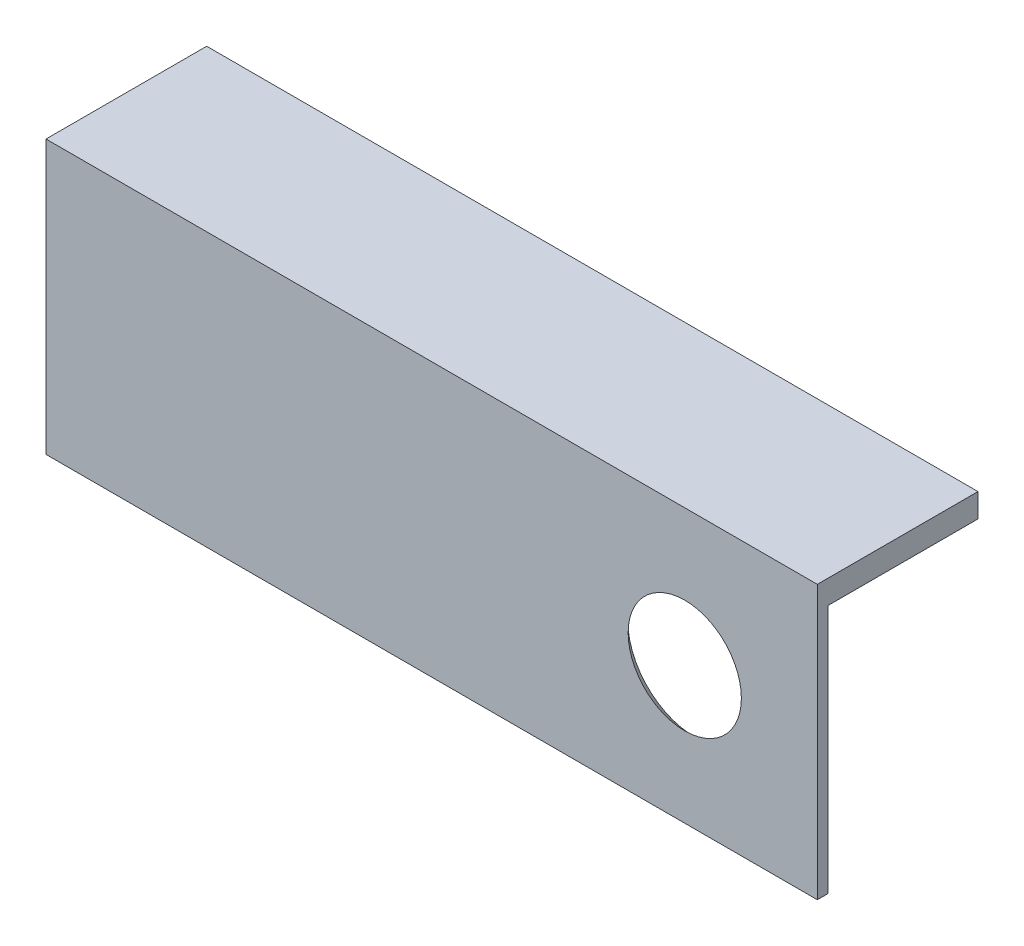
ISO-10303-21;
HEADER;
FILE_DESCRIPTION(('STEP AP214'),'2;1');
FILE_NAME('part.step','',(''),(''),'','','');
FILE_SCHEMA(('AUTOMOTIVE_DESIGN { 1 0 10303 214 1 1 1 1 }'));
ENDSEC;
DATA;
#1=APPLICATION_CONTEXT('core data for automotive mechanical design processes');
#2=APPLICATION_PROTOCOL_DEFINITION('international standard','automotive_design',2000,#1);
#3=PRODUCT_CONTEXT('',#1,'mechanical');
#4=PRODUCT('Part','Part','',(#3));
#5=PRODUCT_RELATED_PRODUCT_CATEGORY('part','',(#4));
#6=PRODUCT_DEFINITION_FORMATION('','',#4);
#7=PRODUCT_DEFINITION_CONTEXT('part definition',#1,'design');
#8=PRODUCT_DEFINITION('design','',#6,#7);
#9=PRODUCT_DEFINITION_SHAPE('','',#8);
#10=(LENGTH_UNIT() NAMED_UNIT(*) SI_UNIT(.MILLI.,.METRE.));
#11=(NAMED_UNIT(*) PLANE_ANGLE_UNIT() SI_UNIT($,.RADIAN.));
#12=(NAMED_UNIT(*) SI_UNIT($,.STERADIAN.) SOLID_ANGLE_UNIT());
#13=UNCERTAINTY_MEASURE_WITH_UNIT(LENGTH_MEASURE(1.E-05),#10,'distance_accuracy_value','');
#14=(GEOMETRIC_REPRESENTATION_CONTEXT(3) GLOBAL_UNCERTAINTY_ASSIGNED_CONTEXT((#13)) GLOBAL_UNIT_ASSIGNED_CONTEXT((#10,
#11,#12)) REPRESENTATION_CONTEXT('',''));
#15=CARTESIAN_POINT('',(0.,0.,0.));
#16=DIRECTION('',(0.,0.,1.));
#17=DIRECTION('',(1.,0.,0.));
#18=AXIS2_PLACEMENT_3D('',#15,#16,#17);
#19=CARTESIAN_POINT('',(0.,0.,10.));
#20=DIRECTION('',(0.,0.,1.));
#21=DIRECTION('',(1.,0.,0.));
#22=AXIS2_PLACEMENT_3D('',#19,#20,#21);
#23=PLANE('',#22);
#24=CARTESIAN_POINT('',(15.7508026527941,0.,10.));
#25=DIRECTION('',(0.,0.,1.));
#26=DIRECTION('',(1.,0.,0.));
#27=AXIS2_PLACEMENT_3D('',#24,#25,#26);
#28=CIRCLE('',#27,3.52287724515009);
#29=CARTESIAN_POINT('',(19.2736798979442,0.,10.));
#30=VERTEX_POINT('',#29);
#31=EDGE_CURVE('E40',#30,#30,#28,.T.);
#32=ORIENTED_EDGE('',*,*,#31,.F.);
#33=EDGE_LOOP('',(#32));
#34=FACE_BOUND('',#33,.T.);
#35=DIRECTION('',(0.,1.,0.));
#36=VECTOR('',#35,1.);
#37=CARTESIAN_POINT('',(24.,8.5,10.));
#38=LINE('',#37,#36);
#39=CARTESIAN_POINT('',(24.,-8.5,10.));
#40=VERTEX_POINT('',#39);
#41=CARTESIAN_POINT('',(24.,8.5,10.));
#42=VERTEX_POINT('',#41);
#43=EDGE_CURVE('E118',#40,#42,#38,.T.);
#44=ORIENTED_EDGE('',*,*,#43,.T.);
#45=DIRECTION('',(-1.,0.,0.));
#46=VECTOR('',#45,1.);
#47=CARTESIAN_POINT('',(-24.,8.5,10.));
#48=LINE('',#47,#46);
#49=CARTESIAN_POINT('',(-24.,8.5,10.));
#50=VERTEX_POINT('',#49);
#51=EDGE_CURVE('E81',#42,#50,#48,.T.);
#52=ORIENTED_EDGE('',*,*,#51,.T.);
#53=DIRECTION('',(0.,-1.,0.));
#54=VECTOR('',#53,1.);
#55=CARTESIAN_POINT('',(-24.,8.5,10.));
#56=LINE('',#55,#54);
#57=CARTESIAN_POINT('',(-24.,-8.5,10.));
#58=VERTEX_POINT('',#57);
#59=EDGE_CURVE('E121',#50,#58,#56,.T.);
#60=ORIENTED_EDGE('',*,*,#59,.T.);
#61=DIRECTION('',(1.,0.,0.));
#62=VECTOR('',#61,1.);
#63=CARTESIAN_POINT('',(-24.,-8.5,10.));
#64=LINE('',#63,#62);
#65=EDGE_CURVE('E61',#58,#40,#64,.T.);
#66=ORIENTED_EDGE('',*,*,#65,.T.);
#67=EDGE_LOOP('',(#44,#52,#60,#66));
#68=FACE_BOUND('',#67,.T.);
#69=ADVANCED_FACE('F36',(#34,#68),#23,.T.);
#70=CARTESIAN_POINT('',(24.,8.5,10.));
#71=DIRECTION('',(-1.,0.,0.));
#72=DIRECTION('',(0.,-1.,0.));
#73=AXIS2_PLACEMENT_3D('',#70,#71,#72);
#74=PLANE('',#73);
#75=DIRECTION('',(0.,1.,0.));
#76=VECTOR('',#75,1.);
#77=CARTESIAN_POINT('',(24.,7.02418619284928,9.346110156475));
#78=LINE('',#77,#76);
#79=CARTESIAN_POINT('',(24.,-8.49999999999999,9.346110156475));
#80=VERTEX_POINT('',#79);
#81=CARTESIAN_POINT('',(24.,7.02418619284928,9.346110156475));
#82=VERTEX_POINT('',#81);
#83=EDGE_CURVE('E96',#80,#82,#78,.T.);
#84=ORIENTED_EDGE('',*,*,#83,.T.);
#85=DIRECTION('',(0.,0.,-1.));
#86=VECTOR('',#85,1.);
#87=CARTESIAN_POINT('',(24.,7.02418619284928,0.));
#88=LINE('',#87,#86);
#89=CARTESIAN_POINT('',(24.,7.02418619284928,0.));
#90=VERTEX_POINT('',#89);
#91=EDGE_CURVE('E107',#82,#90,#88,.T.);
#92=ORIENTED_EDGE('',*,*,#91,.T.);
#93=DIRECTION('',(0.,1.,0.));
#94=VECTOR('',#93,1.);
#95=CARTESIAN_POINT('',(24.,8.5,0.));
#96=LINE('',#95,#94);
#97=CARTESIAN_POINT('',(24.,8.5,0.));
#98=VERTEX_POINT('',#97);
#99=EDGE_CURVE('E137',#90,#98,#96,.T.);
#100=ORIENTED_EDGE('',*,*,#99,.T.);
#101=DIRECTION('',(0.,0.,-1.));
#102=VECTOR('',#101,1.);
#103=CARTESIAN_POINT('',(24.,8.5,10.));
#104=LINE('',#103,#102);
#105=EDGE_CURVE('E11',#42,#98,#104,.T.);
#106=ORIENTED_EDGE('',*,*,#105,.F.);
#107=ORIENTED_EDGE('',*,*,#43,.F.);
#108=DIRECTION('',(0.,0.,-1.));
#109=VECTOR('',#108,1.);
#110=CARTESIAN_POINT('',(24.,-8.5,10.));
#111=LINE('',#110,#109);
#112=EDGE_CURVE('E112',#40,#80,#111,.T.);
#113=ORIENTED_EDGE('',*,*,#112,.T.);
#114=EDGE_LOOP('',(#84,#92,#100,#106,#107,#113));
#115=FACE_BOUND('',#114,.T.);
#116=ADVANCED_FACE('F38',(#115),#74,.F.);
#117=CARTESIAN_POINT('',(-24.,8.5,10.));
#118=DIRECTION('',(0.,-1.,0.));
#119=DIRECTION('',(0.,0.,-1.));
#120=AXIS2_PLACEMENT_3D('',#117,#118,#119);
#121=PLANE('',#120);
#122=DIRECTION('',(-1.,0.,0.));
#123=VECTOR('',#122,1.);
#124=CARTESIAN_POINT('',(-24.,8.5,0.));
#125=LINE('',#124,#123);
#126=CARTESIAN_POINT('',(-24.,8.5,0.));
#127=VERTEX_POINT('',#126);
#128=EDGE_CURVE('E76',#98,#127,#125,.T.);
#129=ORIENTED_EDGE('',*,*,#128,.T.);
#130=DIRECTION('',(0.,0.,-1.));
#131=VECTOR('',#130,1.);
#132=CARTESIAN_POINT('',(-24.,8.5,10.));
#133=LINE('',#132,#131);
#134=EDGE_CURVE('E45',#50,#127,#133,.T.);
#135=ORIENTED_EDGE('',*,*,#134,.F.);
#136=ORIENTED_EDGE('',*,*,#51,.F.);
#137=ORIENTED_EDGE('',*,*,#105,.T.);
#138=EDGE_LOOP('',(#129,#135,#136,#137));
#139=FACE_BOUND('',#138,.T.);
#140=ADVANCED_FACE('F159',(#139),#121,.F.);
#141=CARTESIAN_POINT('',(-24.,8.5,10.));
#142=DIRECTION('',(1.,0.,0.));
#143=DIRECTION('',(0.,1.,0.));
#144=AXIS2_PLACEMENT_3D('',#141,#142,#143);
#145=PLANE('',#144);
#146=DIRECTION('',(0.,-1.,0.));
#147=VECTOR('',#146,1.);
#148=CARTESIAN_POINT('',(-24.,8.5,0.));
#149=LINE('',#148,#147);
#150=CARTESIAN_POINT('',(-24.,7.02418619284927,0.));
#151=VERTEX_POINT('',#150);
#152=EDGE_CURVE('E124',#127,#151,#149,.T.);
#153=ORIENTED_EDGE('',*,*,#152,.T.);
#154=DIRECTION('',(0.,0.,-1.));
#155=VECTOR('',#154,1.);
#156=CARTESIAN_POINT('',(-24.,7.02418619284927,0.));
#157=LINE('',#156,#155);
#158=CARTESIAN_POINT('',(-24.,7.02418619284927,9.346110156475));
#159=VERTEX_POINT('',#158);
#160=EDGE_CURVE('E52',#159,#151,#157,.T.);
#161=ORIENTED_EDGE('',*,*,#160,.F.);
#162=DIRECTION('',(0.,1.,0.));
#163=VECTOR('',#162,1.);
#164=CARTESIAN_POINT('',(-24.,7.02418619284927,9.346110156475));
#165=LINE('',#164,#163);
#166=CARTESIAN_POINT('',(-24.,-8.5,9.346110156475));
#167=VERTEX_POINT('',#166);
#168=EDGE_CURVE('E145',#167,#159,#165,.T.);
#169=ORIENTED_EDGE('',*,*,#168,.F.);
#170=DIRECTION('',(0.,0.,-1.));
#171=VECTOR('',#170,1.);
#172=CARTESIAN_POINT('',(-24.,-8.5,10.));
#173=LINE('',#172,#171);
#174=EDGE_CURVE('E115',#58,#167,#173,.T.);
#175=ORIENTED_EDGE('',*,*,#174,.F.);
#176=ORIENTED_EDGE('',*,*,#59,.F.);
#177=ORIENTED_EDGE('',*,*,#134,.T.);
#178=EDGE_LOOP('',(#153,#161,#169,#175,#176,#177));
#179=FACE_BOUND('',#178,.T.);
#180=ADVANCED_FACE('F131',(#179),#145,.F.);
#181=CARTESIAN_POINT('',(-24.,-8.5,10.));
#182=DIRECTION('',(0.,1.,0.));
#183=DIRECTION('',(0.,0.,1.));
#184=AXIS2_PLACEMENT_3D('',#181,#182,#183);
#185=PLANE('',#184);
#186=ORIENTED_EDGE('',*,*,#174,.T.);
#187=DIRECTION('',(-1.,0.,0.));
#188=VECTOR('',#187,1.);
#189=CARTESIAN_POINT('',(24.,-8.49999999999999,9.346110156475));
#190=LINE('',#189,#188);
#191=EDGE_CURVE('E100',#80,#167,#190,.T.);
#192=ORIENTED_EDGE('',*,*,#191,.F.);
#193=ORIENTED_EDGE('',*,*,#112,.F.);
#194=ORIENTED_EDGE('',*,*,#65,.F.);
#195=EDGE_LOOP('',(#186,#192,#193,#194));
#196=FACE_BOUND('',#195,.T.);
#197=ADVANCED_FACE('F111',(#196),#185,.F.);
#198=CARTESIAN_POINT('',(0.,0.,0.));
#199=DIRECTION('',(0.,0.,1.));
#200=DIRECTION('',(1.,0.,0.));
#201=AXIS2_PLACEMENT_3D('',#198,#199,#200);
#202=PLANE('',#201);
#203=ORIENTED_EDGE('',*,*,#99,.F.);
#204=DIRECTION('',(-1.,0.,0.));
#205=VECTOR('',#204,1.);
#206=CARTESIAN_POINT('',(24.,7.02418619284928,0.));
#207=LINE('',#206,#205);
#208=EDGE_CURVE('E135',#90,#151,#207,.T.);
#209=ORIENTED_EDGE('',*,*,#208,.T.);
#210=ORIENTED_EDGE('',*,*,#152,.F.);
#211=ORIENTED_EDGE('',*,*,#128,.F.);
#212=EDGE_LOOP('',(#203,#209,#210,#211));
#213=FACE_BOUND('',#212,.T.);
#214=ADVANCED_FACE('F134',(#213),#202,.F.);
#215=CARTESIAN_POINT('',(24.,7.02418619284928,0.));
#216=DIRECTION('',(0.,1.,0.));
#217=DIRECTION('',(-1.,0.,0.));
#218=AXIS2_PLACEMENT_3D('',#215,#216,#217);
#219=PLANE('',#218);
#220=ORIENTED_EDGE('',*,*,#160,.T.);
#221=ORIENTED_EDGE('',*,*,#208,.F.);
#222=ORIENTED_EDGE('',*,*,#91,.F.);
#223=DIRECTION('',(-1.,0.,0.));
#224=VECTOR('',#223,1.);
#225=CARTESIAN_POINT('',(24.,7.02418619284928,9.346110156475));
#226=LINE('',#225,#224);
#227=EDGE_CURVE('E102',#82,#159,#226,.T.);
#228=ORIENTED_EDGE('',*,*,#227,.T.);
#229=EDGE_LOOP('',(#220,#221,#222,#228));
#230=FACE_BOUND('',#229,.T.);
#231=ADVANCED_FACE('F170',(#230),#219,.F.);
#232=CARTESIAN_POINT('',(24.,7.02418619284928,9.346110156475));
#233=DIRECTION('',(0.,0.,1.));
#234=DIRECTION('',(1.,0.,0.));
#235=AXIS2_PLACEMENT_3D('',#232,#233,#234);
#236=PLANE('',#235);
#237=CARTESIAN_POINT('',(15.7508026527941,0.,9.346110156475));
#238=DIRECTION('',(0.,0.,-1.));
#239=DIRECTION('',(-1.,0.,0.));
#240=AXIS2_PLACEMENT_3D('',#237,#238,#239);
#241=CIRCLE('',#240,4.2);
#242=CARTESIAN_POINT('',(11.5508026527941,0.,9.346110156475));
#243=VERTEX_POINT('',#242);
#244=EDGE_CURVE('E148',#243,#243,#241,.T.);
#245=ORIENTED_EDGE('',*,*,#244,.F.);
#246=EDGE_LOOP('',(#245));
#247=FACE_BOUND('',#246,.T.);
#248=ORIENTED_EDGE('',*,*,#168,.T.);
#249=ORIENTED_EDGE('',*,*,#227,.F.);
#250=ORIENTED_EDGE('',*,*,#83,.F.);
#251=ORIENTED_EDGE('',*,*,#191,.T.);
#252=EDGE_LOOP('',(#248,#249,#250,#251));
#253=FACE_BOUND('',#252,.T.);
#254=ADVANCED_FACE('F99',(#247,#253),#236,.F.);
#255=CARTESIAN_POINT('',(15.7508026527941,0.,9.346110156475));
#256=DIRECTION('',(0.,0.,-1.));
#257=DIRECTION('',(-1.,0.,0.));
#258=AXIS2_PLACEMENT_3D('',#255,#256,#257);
#259=CONICAL_SURFACE('',#258,4.2,0.802851455917391);
#260=ORIENTED_EDGE('',*,*,#31,.T.);
#261=EDGE_LOOP('',(#260));
#262=FACE_BOUND('',#261,.T.);
#263=ORIENTED_EDGE('',*,*,#244,.T.);
#264=EDGE_LOOP('',(#263));
#265=FACE_BOUND('',#264,.T.);
#266=ADVANCED_FACE('F155',(#262,#265),#259,.F.);
#267=CLOSED_SHELL('',(#69,#116,#140,#180,#197,#214,#231,#254,#266));
#268=MANIFOLD_SOLID_BREP('B2',#267);
#269=ADVANCED_BREP_SHAPE_REPRESENTATION('',(#18,#268),#14);
#270=SHAPE_DEFINITION_REPRESENTATION(#9,#269);
ENDSEC;
END-ISO-10303-21;
